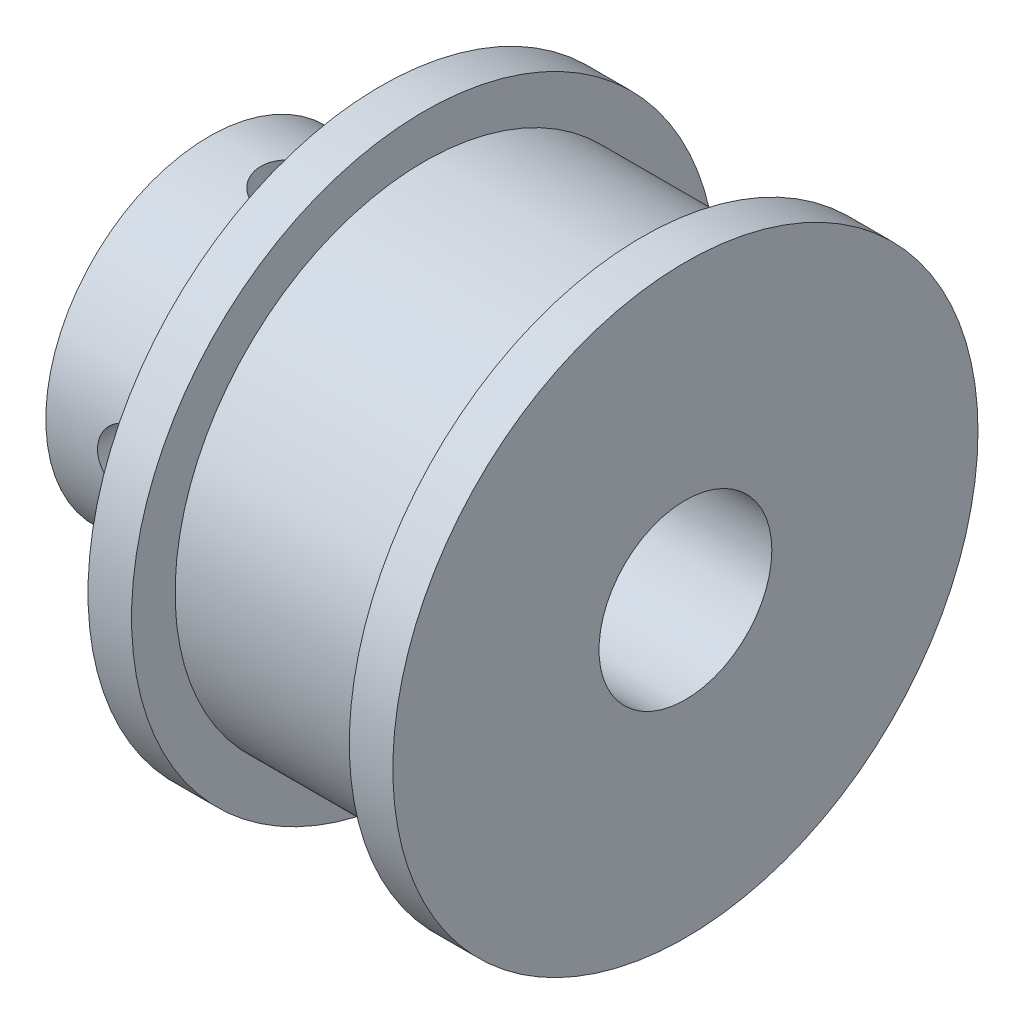
ISO-10303-21;
HEADER;
FILE_DESCRIPTION(('STEP AP214'),'2;1');
FILE_NAME('part.step','',(''),(''),'','','');
FILE_SCHEMA(('AUTOMOTIVE_DESIGN { 1 0 10303 214 1 1 1 1 }'));
ENDSEC;
DATA;
#1=APPLICATION_CONTEXT('core data for automotive mechanical design processes');
#2=APPLICATION_PROTOCOL_DEFINITION('international standard','automotive_design',2000,#1);
#3=PRODUCT_CONTEXT('',#1,'mechanical');
#4=PRODUCT('Part','Part','',(#3));
#5=PRODUCT_RELATED_PRODUCT_CATEGORY('part','',(#4));
#6=PRODUCT_DEFINITION_FORMATION('','',#4);
#7=PRODUCT_DEFINITION_CONTEXT('part definition',#1,'design');
#8=PRODUCT_DEFINITION('design','',#6,#7);
#9=PRODUCT_DEFINITION_SHAPE('','',#8);
#10=(LENGTH_UNIT() NAMED_UNIT(*) SI_UNIT(.MILLI.,.METRE.));
#11=(NAMED_UNIT(*) PLANE_ANGLE_UNIT() SI_UNIT($,.RADIAN.));
#12=(NAMED_UNIT(*) SI_UNIT($,.STERADIAN.) SOLID_ANGLE_UNIT());
#13=UNCERTAINTY_MEASURE_WITH_UNIT(LENGTH_MEASURE(1.E-05),#10,'distance_accuracy_value','');
#14=(GEOMETRIC_REPRESENTATION_CONTEXT(3) GLOBAL_UNCERTAINTY_ASSIGNED_CONTEXT((#13)) GLOBAL_UNIT_ASSIGNED_CONTEXT((#10,
#11,#12)) REPRESENTATION_CONTEXT('',''));
#15=CARTESIAN_POINT('',(0.,0.,0.));
#16=DIRECTION('',(0.,0.,1.));
#17=DIRECTION('',(1.,0.,0.));
#18=AXIS2_PLACEMENT_3D('',#15,#16,#17);
#19=CARTESIAN_POINT('',(0.,0.,0.));
#20=DIRECTION('',(1.,0.,0.));
#21=DIRECTION('',(0.,0.,-1.));
#22=AXIS2_PLACEMENT_3D('',#19,#20,#21);
#23=CYLINDRICAL_SURFACE('',#22,3.175);
#24=CARTESIAN_POINT('',(1.90000000000001,0.,3.175));
#25=CARTESIAN_POINT('',(1.9000068627745,0.0672847316330924,3.17499501338285));
#26=CARTESIAN_POINT('',(1.90546359305505,0.1346703640608,3.17283650663751));
#27=CARTESIAN_POINT('',(1.92710352845715,0.267542369031608,3.16441250521978));
#28=CARTESIAN_POINT('',(1.94331412522152,0.333023444641002,3.15813652319774));
#29=CARTESIAN_POINT('',(1.9857829777871,0.459957962416117,3.14215557601542));
#30=CARTESIAN_POINT('',(2.01200951215206,0.521423409993961,3.1324614438269));
#31=CARTESIAN_POINT('',(2.07364090841074,0.63903164640658,3.11060223187218));
#32=CARTESIAN_POINT('',(2.1090429677438,0.695176053354679,3.09843790684371));
#33=CARTESIAN_POINT('',(2.1897376821198,0.803199302091193,3.07224897424454));
#34=CARTESIAN_POINT('',(2.23538195508738,0.854801684849634,3.05816785515032));
#35=CARTESIAN_POINT('',(2.33452307874792,0.949851027050096,3.029995134943));
#36=CARTESIAN_POINT('',(2.38802352829044,0.993294227940917,3.01590353198658));
#37=CARTESIAN_POINT('',(2.5041424024409,1.07262244667806,2.98863572549245));
#38=CARTESIAN_POINT('',(2.56705314443539,1.10810421355732,2.97552454842956));
#39=CARTESIAN_POINT('',(2.698544027874,1.16785949338492,2.95258553832485));
#40=CARTESIAN_POINT('',(2.7671215628923,1.19213812572271,2.94275620617845));
#41=CARTESIAN_POINT('',(2.90482457540723,1.22768807019404,2.92809906106053));
#42=CARTESIAN_POINT('',(2.97379138336201,1.2394876533875,2.92306908743274));
#43=CARTESIAN_POINT('',(3.11289538673181,1.25139521634013,2.91799267608066));
#44=CARTESIAN_POINT('',(3.18303201481214,1.2515087076257,2.91794388907308));
#45=CARTESIAN_POINT('',(3.31747264612622,1.24044215294952,2.92266241514435));
#46=CARTESIAN_POINT('',(3.38185243388379,1.2300187638983,2.9271070555664));
#47=CARTESIAN_POINT('',(3.50786207063953,1.19943319152663,2.93977143360488));
#48=CARTESIAN_POINT('',(3.56949145415953,1.17926936651212,2.94799180758784));
#49=CARTESIAN_POINT('',(3.68970949878321,1.12939589279822,2.9674595549287));
#50=CARTESIAN_POINT('',(3.74821240698525,1.09950293840843,2.97876432051874));
#51=CARTESIAN_POINT('',(3.85958183190654,1.03114819003906,3.00311044973729));
#52=CARTESIAN_POINT('',(3.91244626347388,0.992683242204219,3.01615245182717));
#53=CARTESIAN_POINT('',(4.01519223792226,0.90489847311778,3.04369028436772));
#54=CARTESIAN_POINT('',(4.06455620057866,0.854982538626526,3.05822195069566));
#55=CARTESIAN_POINT('',(4.15437521291328,0.747422600693478,3.08627133748347));
#56=CARTESIAN_POINT('',(4.19482859712145,0.68977715576794,3.09978886808114));
#57=CARTESIAN_POINT('',(4.26632885010501,0.566964697663757,3.12460676760529));
#58=CARTESIAN_POINT('',(4.29718676961865,0.501677729871156,3.13586122258918));
#59=CARTESIAN_POINT('',(4.34730502697112,0.366284378650628,3.15453954285868));
#60=CARTESIAN_POINT('',(4.36657106552982,0.296180383098904,3.16196529078971));
#61=CARTESIAN_POINT('',(4.39192526522841,0.15748598181363,3.17180954080983));
#62=CARTESIAN_POINT('',(4.398709348115,0.08904145870925,3.174492125026));
#63=CARTESIAN_POINT('',(4.4009546291958,-0.0480536320474739,3.17537559014029));
#64=CARTESIAN_POINT('',(4.39641864995898,-0.116704144074904,3.17357758823769));
#65=CARTESIAN_POINT('',(4.3766688987383,-0.249146112043378,3.1658751934269));
#66=CARTESIAN_POINT('',(4.36192521803439,-0.313019327348947,3.16015168509209));
#67=CARTESIAN_POINT('',(4.32281288402532,-0.437330047990826,3.14535985768854));
#68=CARTESIAN_POINT('',(4.29844298886303,-0.497767108885045,3.1362911070673));
#69=CARTESIAN_POINT('',(4.23997777394203,-0.615550644692232,3.11535083253378));
#70=CARTESIAN_POINT('',(4.20560984846939,-0.672747743207499,3.10340262881889));
#71=CARTESIAN_POINT('',(4.12842792642724,-0.780761917259374,3.07800576012949));
#72=CARTESIAN_POINT('',(4.08561060602606,-0.831576469108153,3.06455650557748));
#73=CARTESIAN_POINT('',(3.98952965745297,-0.928791348114859,3.0365593899859));
#74=CARTESIAN_POINT('',(3.93577293586608,-0.974701227513619,3.02199629492691));
#75=CARTESIAN_POINT('',(3.82105274982168,-1.05696284943212,2.99421855171024));
#76=CARTESIAN_POINT('',(3.76008825217309,-1.09331321924023,2.98100409737911));
#77=CARTESIAN_POINT('',(3.63187774635261,-1.15559997165607,2.95742074651155));
#78=CARTESIAN_POINT('',(3.56458459593159,-1.18144907129597,2.9470759174758));
#79=CARTESIAN_POINT('',(3.4260725952737,-1.2212562072246,2.93080697789355));
#80=CARTESIAN_POINT('',(3.35485655568267,-1.23522264211379,2.92487974538276));
#81=CARTESIAN_POINT('',(3.21589405502895,-1.25007804085777,2.91855940228496));
#82=CARTESIAN_POINT('',(3.1482538653394,-1.25181430561831,2.91780781401761));
#83=CARTESIAN_POINT('',(3.01369577979596,-1.24437120429059,2.92098982763324));
#84=CARTESIAN_POINT('',(2.94677779981834,-1.23519312367105,2.92492287776943));
#85=CARTESIAN_POINT('',(2.81810207173594,-1.20686591196944,2.93671925445626));
#86=CARTESIAN_POINT('',(2.75624498467543,-1.18809939057282,2.9444313340829));
#87=CARTESIAN_POINT('',(2.63652982106708,-1.14148049607648,2.96281485611587));
#88=CARTESIAN_POINT('',(2.57867280512971,-1.1136257243581,2.97348707966731));
#89=CARTESIAN_POINT('',(2.4650674647447,-1.04781462002773,2.99733186522452));
#90=CARTESIAN_POINT('',(2.40961923756217,-1.00937948877753,3.01061106475901));
#91=CARTESIAN_POINT('',(2.30568987821778,-0.924206507043676,3.0378387527675));
#92=CARTESIAN_POINT('',(2.25721118976831,-0.877465757163235,3.05178747371865));
#93=CARTESIAN_POINT('',(2.16551587816836,-0.773553196077986,3.07982295515274));
#94=CARTESIAN_POINT('',(2.12281309958007,-0.715913819660185,3.09386447942524));
#95=CARTESIAN_POINT('',(2.04769454049986,-0.5937664037964,3.11960779538581));
#96=CARTESIAN_POINT('',(2.01528012935281,-0.529257451559142,3.13130927554577));
#97=CARTESIAN_POINT('',(1.96417540099936,-0.400855491445671,3.15020502613284));
#98=CARTESIAN_POINT('',(1.94455266817755,-0.337376283301317,3.15769788512325));
#99=CARTESIAN_POINT('',(1.91563614784328,-0.207895662632507,3.16884766902594));
#100=CARTESIAN_POINT('',(1.90631397142025,-0.141901703524203,3.17251513536217));
#101=CARTESIAN_POINT('',(1.90076135384054,-0.0504531001608372,3.17470085654944));
#102=CARTESIAN_POINT('',(1.8999974262687,-0.0252336457199433,3.17500187012012));
#103=CARTESIAN_POINT('',(1.90000000000001,0.,3.175));
#104=B_SPLINE_CURVE_WITH_KNOTS('',3,(#24,#25,#26,#27,#28,#29,#30,#31,#32,#33,#34,#35,#36,#37,
#38,#39,#40,#41,#42,#43,#44,#45,#46,#47,#48,#49,#50,#51,#52,#53,#54,#55,#56,#57,#58,#59,#60,#61,
#62,#63,#64,#65,#66,#67,#68,#69,#70,#71,#72,#73,#74,#75,#76,#77,#78,#79,#80,#81,#82,#83,#84,#85,
#86,#87,#88,#89,#90,#91,#92,#93,#94,#95,#96,#97,#98,#99,#100,#101,#102,#103),.UNSPECIFIED.,.T.,
.F.,(4,2,2,2,2,2,2,2,2,2,2,2,2,2,2,2,2,2,2,2,2,2,2,2,2,2,2,2,2,2,2,2,2,2,2,2,2,2,2,4),(0.,
0.201779437744548,0.404074820308127,0.605734757050763,0.807333171478417,1.01735976436243,
1.2274828705813,1.44660259463333,1.66562209023744,1.87494520835713,2.08416960269575,
2.27936669865592,2.47459670544107,2.67374147234743,2.87295963102294,3.08705517744558,
3.30119070642572,3.51930901537433,3.73731996902137,3.94275765182502,4.14814411546712,
4.34465147529728,4.54118419440118,4.7436789821994,4.94625358697288,5.1617892735487,
5.37735589340512,5.59467927329235,5.81184892233299,6.01381057507249,6.21574844354767,
6.41019345194811,6.60468982086286,6.81009090996547,7.01556384361703,7.2337987698656,
7.45206273023339,7.65177261299093,7.85093070050895,7.92660360165657),.UNSPECIFIED.);
#105=CARTESIAN_POINT('',(1.90000000000001,0.,3.175));
#106=VERTEX_POINT('',#105);
#107=EDGE_CURVE('E712',#106,#106,#104,.T.);
#108=ORIENTED_EDGE('',*,*,#107,.F.);
#109=EDGE_LOOP('',(#108));
#110=FACE_BOUND('',#109,.T.);
#111=CARTESIAN_POINT('',(3.15,2.91858270398493,-1.25));
#112=CARTESIAN_POINT('',(3.21705876770274,2.91858919552523,-1.24999286391997));
#113=CARTESIAN_POINT('',(3.28421776991305,2.92092645038722,-1.24457161253238));
#114=CARTESIAN_POINT('',(3.41661509708975,2.92998517442319,-1.2230858011541));
#115=CARTESIAN_POINT('',(3.48184795863823,2.93671805691524,-1.20699353198018));
#116=CARTESIAN_POINT('',(3.60825570633315,2.95367783504784,-1.16486992778129));
#117=CARTESIAN_POINT('',(3.66944461339327,2.96389181028401,-1.13887530486567));
#118=CARTESIAN_POINT('',(3.78657755098346,2.98664490940932,-1.07779173231123));
#119=CARTESIAN_POINT('',(3.84252284402701,2.99918347142755,-1.04270497949831));
#120=CARTESIAN_POINT('',(3.95071189018399,3.02595080926506,-0.962353829492942));
#121=CARTESIAN_POINT('',(4.00262881457917,3.04023283739072,-0.916666915264533));
#122=CARTESIAN_POINT('',(4.09830169841413,3.06843728874988,-0.817302314146456));
#123=CARTESIAN_POINT('',(4.1420548518516,3.08235958692784,-0.763621891133198));
#124=CARTESIAN_POINT('',(4.22176349783716,3.10891201177461,-0.64728579706301));
#125=CARTESIAN_POINT('',(4.25735944266869,3.12147292007291,-0.584366556004033));
#126=CARTESIAN_POINT('',(4.31732314068053,3.14324422109986,-0.452850465301555));
#127=CARTESIAN_POINT('',(4.34169532800117,3.15245593668199,-0.384255870461471));
#128=CARTESIAN_POINT('',(4.37736018254707,3.16611423056324,-0.2467608971739));
#129=CARTESIAN_POINT('',(4.38921442617454,3.17076466636064,-0.178026840226493));
#130=CARTESIAN_POINT('',(4.40131288966092,3.17551190440968,-0.0393983009347702));
#131=CARTESIAN_POINT('',(4.40156129942229,3.17561035000669,0.0304957535146294));
#132=CARTESIAN_POINT('',(4.39075388885007,3.17136802875332,0.165409649899385));
#133=CARTESIAN_POINT('',(4.380312782763,3.16726865978232,0.230487686315578));
#134=CARTESIAN_POINT('',(4.34946532592636,3.15541444614498,0.357881536818985));
#135=CARTESIAN_POINT('',(4.32905824593686,3.14765933397851,0.420197148407344));
#136=CARTESIAN_POINT('',(4.27860558354179,3.12910832817148,0.541410179653869));
#137=CARTESIAN_POINT('',(4.24842031728481,3.11826866169305,0.600242482304685));
#138=CARTESIAN_POINT('',(4.17939703639771,3.09462975143761,0.712157346885298));
#139=CARTESIAN_POINT('',(4.1405560971742,3.08182984578998,0.765237956392509));
#140=CARTESIAN_POINT('',(4.05243182003348,3.05461022779038,0.867739124124568));
#141=CARTESIAN_POINT('',(4.00264013608172,3.04013927358102,0.916709689716655));
#142=CARTESIAN_POINT('',(3.89548656480707,3.01184461230875,1.00578635680649));
#143=CARTESIAN_POINT('',(3.83812236311636,2.99802110488019,1.04588973818711));
#144=CARTESIAN_POINT('',(3.71550154425415,2.9722444532213,1.11707822475766));
#145=CARTESIAN_POINT('',(3.6500754582507,2.96035090580402,1.14789479354929));
#146=CARTESIAN_POINT('',(3.5143696785953,2.94047661183176,1.19789603572418));
#147=CARTESIAN_POINT('',(3.44409305117512,2.93249341875955,1.21708798384633));
#148=CARTESIAN_POINT('',(3.30516034266536,2.92193314346724,1.24221885837745));
#149=CARTESIAN_POINT('',(3.2366574611002,2.9190621155793,1.24887973581001));
#150=CARTESIAN_POINT('',(3.09946758767574,2.91821507641654,1.25085924710212));
#151=CARTESIAN_POINT('',(3.03078065469026,2.92023765193577,1.24618115550066));
#152=CARTESIAN_POINT('',(2.89910081239854,2.92864903711891,1.22627220656949));
#153=CARTESIAN_POINT('',(2.83600149325999,2.93479414330475,1.21162973372095));
#154=CARTESIAN_POINT('',(2.71319369775327,2.95045928061593,1.17296502005911));
#155=CARTESIAN_POINT('',(2.65348596177989,2.95998004539956,1.14894074010909));
#156=CARTESIAN_POINT('',(2.53650689226705,2.98178824537218,1.09112415058302));
#157=CARTESIAN_POINT('',(2.47942723563771,2.99417074871089,1.05698098829747));
#158=CARTESIAN_POINT('',(2.37155358654007,3.02015852173764,0.980258179031947));
#159=CARTESIAN_POINT('',(2.32076210314278,3.03376427580628,0.937675181950988));
#160=CARTESIAN_POINT('',(2.22315311375844,3.06183438952279,0.841703377564378));
#161=CARTESIAN_POINT('',(2.17687527629868,3.07629098175068,0.787761391689884));
#162=CARTESIAN_POINT('',(2.09394958907587,3.1035190255834,0.672529083864432));
#163=CARTESIAN_POINT('',(2.05730202921282,3.1162904264532,0.611238540780897));
#164=CARTESIAN_POINT('',(1.99484313276734,3.13873566281396,0.482904338615098));
#165=CARTESIAN_POINT('',(1.96901930828488,3.14841306493411,0.415867417631866));
#166=CARTESIAN_POINT('',(1.92917965457089,3.16357142711523,0.277927786036162));
#167=CARTESIAN_POINT('',(1.91515764017672,3.16905458518296,0.207027121129187));
#168=CARTESIAN_POINT('',(1.90003726977397,3.17497850608976,0.0682260342168539));
#169=CARTESIAN_POINT('',(1.89817498964644,3.17571727826717,0.000420884757595325));
#170=CARTESIAN_POINT('',(1.90542306137319,3.1728670277863,-0.134500374630681));
#171=CARTESIAN_POINT('',(1.9145318409792,3.16927862524971,-0.201616581901098));
#172=CARTESIAN_POINT('',(1.94291936225415,3.15832315585951,-0.331261459507754));
#173=CARTESIAN_POINT('',(1.96189513645233,3.15106882901496,-0.393866748155006));
#174=CARTESIAN_POINT('',(2.00916415022582,3.13355246801338,-0.514998013360591));
#175=CARTESIAN_POINT('',(2.03745913359075,3.12328987099511,-0.573523223978585));
#176=CARTESIAN_POINT('',(2.10396081746341,3.10021124636329,-0.687642991756168));
#177=CARTESIAN_POINT('',(2.14254680575914,3.08730319204293,-0.742997519181306));
#178=CARTESIAN_POINT('',(2.22796048608835,3.0604965861267,-0.846674739986252));
#179=CARTESIAN_POINT('',(2.27479143506869,3.04659764440369,-0.894994640697079));
#180=CARTESIAN_POINT('',(2.3786645370051,3.01835076024438,-0.986204093974814));
#181=CARTESIAN_POINT('',(2.43614870477354,3.00402537078839,-1.02859889387657));
#182=CARTESIAN_POINT('',(2.55787929604743,2.97745127531598,-1.10316965268165));
#183=CARTESIAN_POINT('',(2.62212660256846,2.96520284101944,-1.13534427499941));
#184=CARTESIAN_POINT('',(2.74980593068555,2.94527735121899,-1.18601952811124));
#185=CARTESIAN_POINT('',(2.81281216952646,2.93729286701932,-1.20547430735444));
#186=CARTESIAN_POINT('',(2.94135798876503,2.92533709276108,-1.23421212719399));
#187=CARTESIAN_POINT('',(3.00688989438575,2.92135450819833,-1.24352380081826));
#188=CARTESIAN_POINT('',(3.09843968257498,2.91892238480656,-1.24920484852849));
#189=CARTESIAN_POINT('',(3.12421242994352,2.91858020765141,-1.25000274419244));
#190=CARTESIAN_POINT('',(3.15,2.91858270398493,-1.25));
#191=B_SPLINE_CURVE_WITH_KNOTS('',3,(#111,#112,#113,#114,#115,#116,#117,#118,#119,#120,#121,
#122,#123,#124,#125,#126,#127,#128,#129,#130,#131,#132,#133,#134,#135,#136,#137,#138,#139,#140,
#141,#142,#143,#144,#145,#146,#147,#148,#149,#150,#151,#152,#153,#154,#155,#156,#157,#158,#159,
#160,#161,#162,#163,#164,#165,#166,#167,#168,#169,#170,#171,#172,#173,#174,#175,#176,#177,#178,
#179,#180,#181,#182,#183,#184,#185,#186,#187,#188,#189,#190),.UNSPECIFIED.,.T.,.F.,(4,2,2,2,2,2,
2,2,2,2,2,2,2,2,2,2,2,2,2,2,2,2,2,2,2,2,2,2,2,2,2,2,2,2,2,2,2,2,2,4),(0.,0.20109806062216,
0.402720363484106,0.603602331741175,0.804435808400704,1.01535170829682,1.22633996993093,
1.44534686764129,1.66426716849029,1.87288447318198,2.08142646291369,2.27861453584364,
2.47581703977309,2.67597098178837,2.87619265497002,3.08919652800103,3.30226565219754,
3.52100766319138,3.73961264265535,3.94518390476032,4.1506958077731,4.34501913391243,
4.5393847197749,4.74148953365143,4.94367473209367,5.16024174600764,5.37681527848653,
5.59313824650931,5.80934777198827,6.01183163883026,6.21428649142563,6.41086299855999,
6.60747630956881,6.81268639074811,7.01797771720266,7.23549456942807,7.45303985660975,
7.65144122721413,7.84928106635439,7.92661368823473),.UNSPECIFIED.);
#192=CARTESIAN_POINT('',(3.15,2.91858270398493,-1.25));
#193=VERTEX_POINT('',#192);
#194=EDGE_CURVE('E728',#193,#193,#191,.T.);
#195=ORIENTED_EDGE('',*,*,#194,.F.);
#196=EDGE_LOOP('',(#195));
#197=FACE_BOUND('',#196,.T.);
#198=CARTESIAN_POINT('',(17.5,0.,0.));
#199=DIRECTION('',(1.,0.,0.));
#200=DIRECTION('',(0.,0.,-1.));
#201=AXIS2_PLACEMENT_3D('',#198,#199,#200);
#202=CIRCLE('',#201,3.175);
#203=CARTESIAN_POINT('',(17.5,0.,-3.175));
#204=VERTEX_POINT('',#203);
#205=EDGE_CURVE('E754',#204,#204,#202,.T.);
#206=ORIENTED_EDGE('',*,*,#205,.T.);
#207=EDGE_LOOP('',(#206));
#208=FACE_BOUND('',#207,.T.);
#209=CARTESIAN_POINT('',(0.,0.,0.));
#210=DIRECTION('',(1.,0.,0.));
#211=DIRECTION('',(0.,0.,-1.));
#212=AXIS2_PLACEMENT_3D('',#209,#210,#211);
#213=CIRCLE('',#212,3.175);
#214=CARTESIAN_POINT('',(0.,0.,-3.175));
#215=VERTEX_POINT('',#214);
#216=EDGE_CURVE('E12',#215,#215,#213,.T.);
#217=ORIENTED_EDGE('',*,*,#216,.F.);
#218=EDGE_LOOP('',(#217));
#219=FACE_BOUND('',#218,.T.);
#220=ADVANCED_FACE('F708',(#110,#197,#208,#219),#23,.F.);
#221=CARTESIAN_POINT('',(0.,3.175,0.));
#222=DIRECTION('',(-1.,0.,0.));
#223=DIRECTION('',(0.,0.,1.));
#224=AXIS2_PLACEMENT_3D('',#221,#222,#223);
#225=PLANE('',#224);
#226=ORIENTED_EDGE('',*,*,#216,.T.);
#227=EDGE_LOOP('',(#226));
#228=FACE_BOUND('',#227,.T.);
#229=CARTESIAN_POINT('',(0.,0.,0.));
#230=DIRECTION('',(1.,0.,0.));
#231=DIRECTION('',(0.,0.,-1.));
#232=AXIS2_PLACEMENT_3D('',#229,#230,#231);
#233=CIRCLE('',#232,6.);
#234=CARTESIAN_POINT('',(0.,0.,-6.));
#235=VERTEX_POINT('',#234);
#236=EDGE_CURVE('E720',#235,#235,#233,.T.);
#237=ORIENTED_EDGE('',*,*,#236,.F.);
#238=EDGE_LOOP('',(#237));
#239=FACE_BOUND('',#238,.T.);
#240=ADVANCED_FACE('F764',(#228,#239),#225,.T.);
#241=CARTESIAN_POINT('',(0.,0.,0.));
#242=DIRECTION('',(1.,0.,0.));
#243=DIRECTION('',(0.,0.,-1.));
#244=AXIS2_PLACEMENT_3D('',#241,#242,#243);
#245=CYLINDRICAL_SURFACE('',#244,6.);
#246=CARTESIAN_POINT('',(1.90000000000001,0.,6.));
#247=CARTESIAN_POINT('',(1.90000247746923,-0.0694090417016603,5.99999871526651));
#248=CARTESIAN_POINT('',(1.90580066571876,-0.138848789520875,5.99878328775043));
#249=CARTESIAN_POINT('',(1.92881934953286,-0.275761316266992,5.99405200990679));
#250=CARTESIAN_POINT('',(1.94604852303694,-0.343232560128311,5.99053441189248));
#251=CARTESIAN_POINT('',(1.99137045492183,-0.474209132291339,5.98159109196202));
#252=CARTESIAN_POINT('',(2.01945239599889,-0.537718336709182,5.97616727052645));
#253=CARTESIAN_POINT('',(2.08564960885619,-0.659120328605954,5.96399927809859));
#254=CARTESIAN_POINT('',(2.12376443115584,-0.717013367534323,5.95725516625975));
#255=CARTESIAN_POINT('',(2.20953634019065,-0.826390324308832,5.9430770002465));
#256=CARTESIAN_POINT('',(2.25731200123509,-0.87778024416268,5.93563505848531));
#257=CARTESIAN_POINT('',(2.36079465919511,-0.971877776769387,5.92095657692448));
#258=CARTESIAN_POINT('',(2.41650231187227,-1.01458467096098,5.91372005416683));
#259=CARTESIAN_POINT('',(2.53495196876616,-1.09051031677216,5.90019442595308));
#260=CARTESIAN_POINT('',(2.59775838450275,-1.1236305468065,5.89391545174828));
#261=CARTESIAN_POINT('',(2.72819745177276,-1.17881119348063,5.8831284065002));
#262=CARTESIAN_POINT('',(2.79582958244254,-1.20087280167641,5.87862014467568));
#263=CARTESIAN_POINT('',(2.93298523741564,-1.23300240133736,5.87196500986123));
#264=CARTESIAN_POINT('',(3.00246835933477,-1.24323597696798,5.86978556855865));
#265=CARTESIAN_POINT('',(3.14219684286263,-1.25193357655614,5.86793690716491));
#266=CARTESIAN_POINT('',(3.2124421188653,-1.25039890894686,5.86826740800981));
#267=CARTESIAN_POINT('',(3.35048102797518,-1.23573719037196,5.87137174319175));
#268=CARTESIAN_POINT('',(3.41829597966121,-1.2228010523272,5.87410533679901));
#269=CARTESIAN_POINT('',(3.55077150964493,-1.18600543529945,5.88164437615942));
#270=CARTESIAN_POINT('',(3.61543192560633,-1.16214539481381,5.88644992841317));
#271=CARTESIAN_POINT('',(3.74030722841598,-1.10400003213928,5.89763191464102));
#272=CARTESIAN_POINT('',(3.80048629652707,-1.06964002534236,5.90401953785586));
#273=CARTESIAN_POINT('',(3.91429574426816,-0.991522699274812,5.91763890010721));
#274=CARTESIAN_POINT('',(3.96792530883597,-0.947764212262582,5.92487074398537));
#275=CARTESIAN_POINT('',(4.06821396108037,-0.851074921546777,5.93953730929909));
#276=CARTESIAN_POINT('',(4.11471616889701,-0.797981433412077,5.94697323199473));
#277=CARTESIAN_POINT('',(4.19818044222897,-0.684667288611794,5.96108088143001));
#278=CARTESIAN_POINT('',(4.23514236459839,-0.624446525025762,5.96775259670236));
#279=CARTESIAN_POINT('',(4.29851008153595,-0.498405541235475,5.97959870942815));
#280=CARTESIAN_POINT('',(4.32489680456711,-0.432575461926497,5.98477039710258));
#281=CARTESIAN_POINT('',(4.36619170483549,-0.297284620972153,5.99301338211281));
#282=CARTESIAN_POINT('',(4.38110139323139,-0.227824338595088,5.99608495596053));
#283=CARTESIAN_POINT('',(4.39879425206788,-0.0885918657008349,5.99974275215455));
#284=CARTESIAN_POINT('',(4.40179194149424,-0.0188480555261788,6.00037293537579));
#285=CARTESIAN_POINT('',(4.39615505003089,0.120143798757714,5.99919952252774));
#286=CARTESIAN_POINT('',(4.3875211813984,0.189391872962257,5.99739607548153));
#287=CARTESIAN_POINT('',(4.35904434653046,0.324726367119811,5.99158564979184));
#288=CARTESIAN_POINT('',(4.33931251461653,0.390837192894204,5.98760052868077));
#289=CARTESIAN_POINT('',(4.28932213957859,0.518811446661328,5.97787227242395));
#290=CARTESIAN_POINT('',(4.25906275913401,0.580674536336772,5.97212899744579));
#291=CARTESIAN_POINT('',(4.18841962176244,0.69929430694349,5.95941241490714));
#292=CARTESIAN_POINT('',(4.14790807043093,0.755973219469829,5.9524239381233));
#293=CARTESIAN_POINT('',(4.05808043692373,0.861805445886515,5.93802568299709));
#294=CARTESIAN_POINT('',(4.00876332448106,0.910957877913281,5.93061585542511));
#295=CARTESIAN_POINT('',(3.9017444230003,1.0011786486518,5.91606024531377));
#296=CARTESIAN_POINT('',(3.84391696804472,1.04209914600204,5.90892089307501));
#297=CARTESIAN_POINT('',(3.72208371578621,1.11364719079243,5.89585601015805));
#298=CARTESIAN_POINT('',(3.65807817586089,1.14427516677863,5.88993042894651));
#299=CARTESIAN_POINT('',(3.52603880370177,1.19417246443921,5.88001700708041));
#300=CARTESIAN_POINT('',(3.45802896283416,1.21350309828031,5.87601872784687));
#301=CARTESIAN_POINT('',(3.31963344950774,1.24044038523407,5.87039184709697));
#302=CARTESIAN_POINT('',(3.24924811838056,1.2480487154444,5.86876290660367));
#303=CARTESIAN_POINT('',(3.10958659900035,1.25125926487611,5.86807907308506));
#304=CARTESIAN_POINT('',(3.04031592977795,1.24709542622725,5.86897402321502));
#305=CARTESIAN_POINT('',(2.90348599107978,1.22739905314031,5.87312447254928));
#306=CARTESIAN_POINT('',(2.8359267051839,1.21186662782265,5.87637994909626));
#307=CARTESIAN_POINT('',(2.70460222810934,1.16998217768584,5.88486132447716));
#308=CARTESIAN_POINT('',(2.64082675351308,1.14366117568421,5.8900815700793));
#309=CARTESIAN_POINT('',(2.51856122397334,1.08097457299757,5.90190705738738));
#310=CARTESIAN_POINT('',(2.46007166036688,1.04460803983029,5.9085124276546));
#311=CARTESIAN_POINT('',(2.34887837292056,0.962073695342405,5.92251579551146));
#312=CARTESIAN_POINT('',(2.29630087543502,0.91573789041822,5.92992613868404));
#313=CARTESIAN_POINT('',(2.19959050677365,0.814924438115329,5.94461839583213));
#314=CARTESIAN_POINT('',(2.15545958244852,0.760444918832963,5.9519002798488));
#315=CARTESIAN_POINT('',(2.07641142681595,0.644134427507699,5.96561444547637));
#316=CARTESIAN_POINT('',(2.04160632011372,0.582225921521345,5.97203596073244));
#317=CARTESIAN_POINT('',(1.98294977156998,0.453319843998451,5.98319908494092));
#318=CARTESIAN_POINT('',(1.95908875281813,0.386326781907242,5.98794216182101));
#319=CARTESIAN_POINT('',(1.92745972171158,0.266015292900104,5.99432499781443));
#320=CARTESIAN_POINT('',(1.91718123679115,0.213367593727928,5.99644035661395));
#321=CARTESIAN_POINT('',(1.90345054572268,0.107152674176536,5.99927832789758));
#322=CARTESIAN_POINT('',(1.89999808733282,0.0535854878488715,6.00000099184586));
#323=CARTESIAN_POINT('',(1.90000000000001,0.,6.));
#324=B_SPLINE_CURVE_WITH_KNOTS('',3,(#246,#247,#248,#249,#250,#251,#252,#253,#254,#255,#256,
#257,#258,#259,#260,#261,#262,#263,#264,#265,#266,#267,#268,#269,#270,#271,#272,#273,#274,#275,
#276,#277,#278,#279,#280,#281,#282,#283,#284,#285,#286,#287,#288,#289,#290,#291,#292,#293,#294,
#295,#296,#297,#298,#299,#300,#301,#302,#303,#304,#305,#306,#307,#308,#309,#310,#311,#312,#313,
#314,#315,#316,#317,#318,#319,#320,#321,#322,#323),.UNSPECIFIED.,.T.,.F.,(4,2,2,2,2,2,2,2,2,2,2,
2,2,2,2,2,2,2,2,2,2,2,2,2,2,2,2,2,2,2,2,2,2,2,2,2,2,2,4),(0.,0.208031045103182,
0.416220199906223,0.624202378825439,0.832175241572985,1.04287526388122,1.25359271551785,
1.46640449178548,1.67919333285489,1.88896575169853,2.09871484767163,2.30501712129058,
2.51133000030278,2.71914592416748,2.92698768368033,3.13889526355464,3.35080602278216,
3.5630972449966,3.77536051045769,3.98378339407673,4.19219351552275,4.39855286632619,
4.60492863390931,4.81401583995734,5.02312752564571,5.23571263829333,5.44828889851306,
5.65970050095022,5.87108185414182,6.07829223291035,6.28550062281358,6.49211731393252,
6.69875319081476,6.90919024830305,7.11967575117366,7.33258864398252,7.54531486464969,
7.70592588477276,7.86653096973387),.UNSPECIFIED.);
#325=CARTESIAN_POINT('',(1.90000000000001,0.,6.));
#326=VERTEX_POINT('',#325);
#327=EDGE_CURVE('E735',#326,#326,#324,.T.);
#328=ORIENTED_EDGE('',*,*,#327,.F.);
#329=EDGE_LOOP('',(#328));
#330=FACE_BOUND('',#329,.T.);
#331=CARTESIAN_POINT('',(3.15,5.86834729715275,-1.25));
#332=CARTESIAN_POINT('',(3.08060938484897,5.86834869213645,-1.24999750877599));
#333=CARTESIAN_POINT('',(3.01118802798478,5.86959145924544,-1.24420229433948));
#334=CARTESIAN_POINT('',(2.87431368268275,5.87442015581798,-1.22119649233779));
#335=CARTESIAN_POINT('',(2.80686224449358,5.87800788138388,-1.20397715440342));
#336=CARTESIAN_POINT('',(2.67592762716513,5.8871029296193,-1.1586839750723));
#337=CARTESIAN_POINT('',(2.6124404040082,5.89260825706945,-1.13062141248932));
#338=CARTESIAN_POINT('',(2.4910755003544,5.90491581335741,-1.06446988601732));
#339=CARTESIAN_POINT('',(2.43319759326998,5.91171798977622,-1.0263813273582));
#340=CARTESIAN_POINT('',(2.32380462484654,5.92596934661468,-0.940636399466082));
#341=CARTESIAN_POINT('',(2.27238810637353,5.93342614373039,-0.892855554869668));
#342=CARTESIAN_POINT('',(2.1782389313519,5.94807966802575,-0.789351223880636));
#343=CARTESIAN_POINT('',(2.13550691170856,5.95527637609915,-0.733627155456002));
#344=CARTESIAN_POINT('',(2.05955411191714,5.96868135118848,-0.615162052999588));
#345=CARTESIAN_POINT('',(2.02642747353674,5.97487958631242,-0.552359428204941));
#346=CARTESIAN_POINT('',(1.97123394714022,5.98550347343302,-0.421928551006719));
#347=CARTESIAN_POINT('',(1.94916593484647,5.98992930561222,-0.354300789950591));
#348=CARTESIAN_POINT('',(1.91702423888253,5.99645589892179,-0.217162904200502));
#349=CARTESIAN_POINT('',(1.90678398280484,5.99858891959926,-0.147693380916357));
#350=CARTESIAN_POINT('',(1.89806830424298,6.00040112580612,-0.00799184883952432));
#351=CARTESIAN_POINT('',(1.8995916558069,6.0000805670369,0.0622400797368385));
#352=CARTESIAN_POINT('',(1.91423460095674,5.99704658090511,0.200326586199572));
#353=CARTESIAN_POINT('',(1.92717471895812,5.99437018956584,0.268201128726475));
#354=CARTESIAN_POINT('',(1.96399862533131,5.98696720898885,0.400793746289752));
#355=CARTESIAN_POINT('',(1.98788287720308,5.98224053291904,0.465511687511022));
#356=CARTESIAN_POINT('',(2.0460800521255,5.97120767323924,0.590460005384683));
#357=CARTESIAN_POINT('',(2.08046229420966,5.96489104125346,0.65065713498165));
#358=CARTESIAN_POINT('',(2.15862800284042,5.95137300440189,0.764493456510647));
#359=CARTESIAN_POINT('',(2.20241263820613,5.94417148958325,0.818131831816418));
#360=CARTESIAN_POINT('',(2.29912162489106,5.92951700233276,0.918394203276912));
#361=CARTESIAN_POINT('',(2.35220305998195,5.92206184975925,0.964866487494794));
#362=CARTESIAN_POINT('',(2.4654820489948,5.90786872648996,1.04827597240488));
#363=CARTESIAN_POINT('',(2.52567976138724,5.9011307717716,1.0852129606998));
#364=CARTESIAN_POINT('',(2.6517122548288,5.88912998409156,1.14856217138454));
#365=CARTESIAN_POINT('',(2.71756065069343,5.88387085232125,1.17494805489727));
#366=CARTESIAN_POINT('',(2.85289161936939,5.8754760641036,1.21623577538673));
#367=CARTESIAN_POINT('',(2.92237367280809,5.87234010507182,1.23113924882349));
#368=CARTESIAN_POINT('',(3.06161970631891,5.86860783239132,1.24880863867017));
#369=CARTESIAN_POINT('',(3.13135458453703,5.86796551863474,1.25179442917998));
#370=CARTESIAN_POINT('',(3.27032581154014,5.86916952018704,1.24613693439294));
#371=CARTESIAN_POINT('',(3.33956219090234,5.87101568152623,1.23749436857863));
#372=CARTESIAN_POINT('',(3.47482051605812,5.87694538226166,1.20901558325484));
#373=CARTESIAN_POINT('',(3.54086866717883,5.88100511282998,1.18929841376871));
#374=CARTESIAN_POINT('',(3.6687239894416,5.8908833850312,1.13935810860919));
#375=CARTESIAN_POINT('',(3.7305307856504,5.89670208191057,1.10913404556146));
#376=CARTESIAN_POINT('',(3.84910644121623,5.90954501937191,1.03854598181485));
#377=CARTESIAN_POINT('',(3.90579220446617,5.91658506648323,0.998045327353962));
#378=CARTESIAN_POINT('',(4.01164324915506,5.93103483993908,0.908234440569878));
#379=CARTESIAN_POINT('',(4.06080768623923,5.93844460766532,0.858923220505172));
#380=CARTESIAN_POINT('',(4.15106271309716,5.95294924316736,0.751900450843339));
#381=CARTESIAN_POINT('',(4.19200409502638,5.9600367471991,0.694061907614551));
#382=CARTESIAN_POINT('',(4.26358875208798,5.97296708772407,0.57220010221636));
#383=CARTESIAN_POINT('',(4.29423248223745,5.97880997920818,0.508177113476881));
#384=CARTESIAN_POINT('',(4.34413867931735,5.98856148270679,0.376142117847919));
#385=CARTESIAN_POINT('',(4.36346916554434,5.99248163136497,0.308156710970195));
#386=CARTESIAN_POINT('',(4.3904144040081,5.99799561410226,0.169813400503473));
#387=CARTESIAN_POINT('',(4.39803069353274,5.99958975342889,0.0994558094616958));
#388=CARTESIAN_POINT('',(4.40126762204851,6.00026408056941,-0.0402133434703387));
#389=CARTESIAN_POINT('',(4.39711189999473,5.99939113754811,-0.109519592177922));
#390=CARTESIAN_POINT('',(4.37741936134707,5.99532874094472,-0.246422870373552));
#391=CARTESIAN_POINT('',(4.36188271359323,5.99213932172839,-0.314019925202702));
#392=CARTESIAN_POINT('',(4.31997220535144,5.98380460077544,-0.445431965492052));
#393=CARTESIAN_POINT('',(4.29362733614689,5.97866453407556,-0.509256550004524));
#394=CARTESIAN_POINT('',(4.230877602268,5.96697995347704,-0.631610567220741));
#395=CARTESIAN_POINT('',(4.19447186165686,5.96043531730246,-0.690139538279511));
#396=CARTESIAN_POINT('',(4.11189033200669,5.94651596786386,-0.80134032129826));
#397=CARTESIAN_POINT('',(4.0655557119433,5.93912880302851,-0.853892633615926));
#398=CARTESIAN_POINT('',(3.96475549900292,5.9244278681135,-0.950552741980385));
#399=CARTESIAN_POINT('',(3.91028797005157,5.91711411595368,-0.994658521571232));
#400=CARTESIAN_POINT('',(3.79399089756656,5.90329191643327,-1.07367451852767));
#401=CARTESIAN_POINT('',(3.73208158853791,5.89679406702551,-1.10846928126994));
#402=CARTESIAN_POINT('',(3.60317484391674,5.88547039658063,-1.16710627925306));
#403=CARTESIAN_POINT('',(3.53618195154699,5.88064310352601,-1.1909581629246));
#404=CARTESIAN_POINT('',(3.41589371843157,5.87414004405196,-1.22256554131861));
#405=CARTESIAN_POINT('',(3.36327046340695,5.87198163591589,-1.2328344900567));
#406=CARTESIAN_POINT('',(3.25710421947899,5.86908475266778,-1.24655254358404));
#407=CARTESIAN_POINT('',(3.20356126768996,5.86834622039193,-1.25000192292741));
#408=CARTESIAN_POINT('',(3.15,5.86834729715275,-1.25));
#409=B_SPLINE_CURVE_WITH_KNOTS('',3,(#331,#332,#333,#334,#335,#336,#337,#338,#339,#340,#341,
#342,#343,#344,#345,#346,#347,#348,#349,#350,#351,#352,#353,#354,#355,#356,#357,#358,#359,#360,
#361,#362,#363,#364,#365,#366,#367,#368,#369,#370,#371,#372,#373,#374,#375,#376,#377,#378,#379,
#380,#381,#382,#383,#384,#385,#386,#387,#388,#389,#390,#391,#392,#393,#394,#395,#396,#397,#398,
#399,#400,#401,#402,#403,#404,#405,#406,#407,#408),.UNSPECIFIED.,.T.,.F.,(4,2,2,2,2,2,2,2,2,2,2,
2,2,2,2,2,2,2,2,2,2,2,2,2,2,2,2,2,2,2,2,2,2,2,2,2,2,2,4),(0.,0.207975654071269,0.41611079241747,
0.624030014802729,0.831940834815791,1.04271333467885,1.25350128663874,1.46629026266844,
1.67905760106933,1.88879048859264,2.09850151896339,2.30497341416461,2.5114540545587,
2.71932871977949,2.9272292410426,3.13905862244913,3.35089272191628,3.56325237332487,
3.77558175387597,3.98397516009792,4.19235567296524,4.39853786231922,4.60473825464031,
4.81383917934651,5.02296356082185,5.23559458753343,5.4482162175904,5.65954599648534,
5.87084803959581,6.07816293922644,6.28547476332981,6.492234105851,6.69901145528173,
6.90938318978573,7.11980508427535,7.33272651358123,7.54545984571988,7.70599867585769,
7.8665310426116),.UNSPECIFIED.);
#410=CARTESIAN_POINT('',(3.15,5.86834729715275,-1.25));
#411=VERTEX_POINT('',#410);
#412=EDGE_CURVE('E734',#411,#411,#409,.T.);
#413=ORIENTED_EDGE('',*,*,#412,.F.);
#414=EDGE_LOOP('',(#413));
#415=FACE_BOUND('',#414,.T.);
#416=ORIENTED_EDGE('',*,*,#236,.T.);
#417=EDGE_LOOP('',(#416));
#418=FACE_BOUND('',#417,.T.);
#419=CARTESIAN_POINT('',(6.3,0.,0.));
#420=DIRECTION('',(1.,0.,0.));
#421=DIRECTION('',(0.,0.,-1.));
#422=AXIS2_PLACEMENT_3D('',#419,#420,#421);
#423=CIRCLE('',#422,6.);
#424=CARTESIAN_POINT('',(6.3,0.,-6.));
#425=VERTEX_POINT('',#424);
#426=EDGE_CURVE('E725',#425,#425,#423,.T.);
#427=ORIENTED_EDGE('',*,*,#426,.F.);
#428=EDGE_LOOP('',(#427));
#429=FACE_BOUND('',#428,.T.);
#430=ADVANCED_FACE('F759',(#330,#415,#418,#429),#245,.T.);
#431=CARTESIAN_POINT('',(6.3,10.75,0.));
#432=DIRECTION('',(-1.,0.,0.));
#433=DIRECTION('',(0.,0.,1.));
#434=AXIS2_PLACEMENT_3D('',#431,#432,#433);
#435=PLANE('',#434);
#436=ORIENTED_EDGE('',*,*,#426,.T.);
#437=EDGE_LOOP('',(#436));
#438=FACE_BOUND('',#437,.T.);
#439=CARTESIAN_POINT('',(6.3,0.,0.));
#440=DIRECTION('',(1.,0.,0.));
#441=DIRECTION('',(0.,0.,-1.));
#442=AXIS2_PLACEMENT_3D('',#439,#440,#441);
#443=CIRCLE('',#442,10.75);
#444=CARTESIAN_POINT('',(6.3,0.,-10.75));
#445=VERTEX_POINT('',#444);
#446=EDGE_CURVE('E780',#445,#445,#443,.T.);
#447=ORIENTED_EDGE('',*,*,#446,.F.);
#448=EDGE_LOOP('',(#447));
#449=FACE_BOUND('',#448,.T.);
#450=ADVANCED_FACE('F763',(#438,#449),#435,.T.);
#451=CARTESIAN_POINT('',(0.,0.,0.));
#452=DIRECTION('',(1.,0.,0.));
#453=DIRECTION('',(0.,0.,-1.));
#454=AXIS2_PLACEMENT_3D('',#451,#452,#453);
#455=CYLINDRICAL_SURFACE('',#454,10.75);
#456=ORIENTED_EDGE('',*,*,#446,.T.);
#457=EDGE_LOOP('',(#456));
#458=FACE_BOUND('',#457,.T.);
#459=CARTESIAN_POINT('',(7.9,0.,0.));
#460=DIRECTION('',(1.,0.,0.));
#461=DIRECTION('',(0.,0.,-1.));
#462=AXIS2_PLACEMENT_3D('',#459,#460,#461);
#463=CIRCLE('',#462,10.75);
#464=CARTESIAN_POINT('',(7.9,0.,-10.75));
#465=VERTEX_POINT('',#464);
#466=EDGE_CURVE('E782',#465,#465,#463,.T.);
#467=ORIENTED_EDGE('',*,*,#466,.F.);
#468=EDGE_LOOP('',(#467));
#469=FACE_BOUND('',#468,.T.);
#470=ADVANCED_FACE('F824',(#458,#469),#455,.T.);
#471=CARTESIAN_POINT('',(7.9,10.75,0.));
#472=DIRECTION('',(1.,0.,0.));
#473=DIRECTION('',(0.,0.,-1.));
#474=AXIS2_PLACEMENT_3D('',#471,#472,#473);
#475=PLANE('',#474);
#476=ORIENTED_EDGE('',*,*,#466,.T.);
#477=EDGE_LOOP('',(#476));
#478=FACE_BOUND('',#477,.T.);
#479=CARTESIAN_POINT('',(7.9,0.,0.));
#480=DIRECTION('',(1.,0.,0.));
#481=DIRECTION('',(0.,0.,-1.));
#482=AXIS2_PLACEMENT_3D('',#479,#480,#481);
#483=CIRCLE('',#482,9.15);
#484=CARTESIAN_POINT('',(7.9,0.,-9.15));
#485=VERTEX_POINT('',#484);
#486=EDGE_CURVE('E787',#485,#485,#483,.T.);
#487=ORIENTED_EDGE('',*,*,#486,.F.);
#488=EDGE_LOOP('',(#487));
#489=FACE_BOUND('',#488,.T.);
#490=ADVANCED_FACE('F821',(#478,#489),#475,.T.);
#491=CARTESIAN_POINT('',(0.,0.,0.));
#492=DIRECTION('',(1.,0.,0.));
#493=DIRECTION('',(0.,0.,-1.));
#494=AXIS2_PLACEMENT_3D('',#491,#492,#493);
#495=CYLINDRICAL_SURFACE('',#494,9.15);
#496=ORIENTED_EDGE('',*,*,#486,.T.);
#497=EDGE_LOOP('',(#496));
#498=FACE_BOUND('',#497,.T.);
#499=CARTESIAN_POINT('',(15.9,0.,0.));
#500=DIRECTION('',(1.,0.,0.));
#501=DIRECTION('',(0.,0.,-1.));
#502=AXIS2_PLACEMENT_3D('',#499,#500,#501);
#503=CIRCLE('',#502,9.15);
#504=CARTESIAN_POINT('',(15.9,0.,-9.15));
#505=VERTEX_POINT('',#504);
#506=EDGE_CURVE('E790',#505,#505,#503,.T.);
#507=ORIENTED_EDGE('',*,*,#506,.F.);
#508=EDGE_LOOP('',(#507));
#509=FACE_BOUND('',#508,.T.);
#510=ADVANCED_FACE('F814',(#498,#509),#495,.T.);
#511=CARTESIAN_POINT('',(15.9,9.15,0.));
#512=DIRECTION('',(-1.,0.,0.));
#513=DIRECTION('',(0.,0.,1.));
#514=AXIS2_PLACEMENT_3D('',#511,#512,#513);
#515=PLANE('',#514);
#516=ORIENTED_EDGE('',*,*,#506,.T.);
#517=EDGE_LOOP('',(#516));
#518=FACE_BOUND('',#517,.T.);
#519=CARTESIAN_POINT('',(15.9,0.,0.));
#520=DIRECTION('',(1.,0.,0.));
#521=DIRECTION('',(0.,0.,-1.));
#522=AXIS2_PLACEMENT_3D('',#519,#520,#521);
#523=CIRCLE('',#522,10.75);
#524=CARTESIAN_POINT('',(15.9,0.,-10.75));
#525=VERTEX_POINT('',#524);
#526=EDGE_CURVE('E793',#525,#525,#523,.T.);
#527=ORIENTED_EDGE('',*,*,#526,.F.);
#528=EDGE_LOOP('',(#527));
#529=FACE_BOUND('',#528,.T.);
#530=ADVANCED_FACE('F809',(#518,#529),#515,.T.);
#531=CARTESIAN_POINT('',(0.,0.,0.));
#532=DIRECTION('',(1.,0.,0.));
#533=DIRECTION('',(0.,0.,-1.));
#534=AXIS2_PLACEMENT_3D('',#531,#532,#533);
#535=CYLINDRICAL_SURFACE('',#534,10.75);
#536=ORIENTED_EDGE('',*,*,#526,.T.);
#537=EDGE_LOOP('',(#536));
#538=FACE_BOUND('',#537,.T.);
#539=CARTESIAN_POINT('',(17.5,0.,0.));
#540=DIRECTION('',(1.,0.,0.));
#541=DIRECTION('',(0.,0.,-1.));
#542=AXIS2_PLACEMENT_3D('',#539,#540,#541);
#543=CIRCLE('',#542,10.75);
#544=CARTESIAN_POINT('',(17.5,0.,-10.75));
#545=VERTEX_POINT('',#544);
#546=EDGE_CURVE('E795',#545,#545,#543,.T.);
#547=ORIENTED_EDGE('',*,*,#546,.F.);
#548=EDGE_LOOP('',(#547));
#549=FACE_BOUND('',#548,.T.);
#550=ADVANCED_FACE('F805',(#538,#549),#535,.T.);
#551=CARTESIAN_POINT('',(17.5,10.75,0.));
#552=DIRECTION('',(1.,0.,0.));
#553=DIRECTION('',(0.,0.,-1.));
#554=AXIS2_PLACEMENT_3D('',#551,#552,#553);
#555=PLANE('',#554);
#556=ORIENTED_EDGE('',*,*,#546,.T.);
#557=EDGE_LOOP('',(#556));
#558=FACE_BOUND('',#557,.T.);
#559=ORIENTED_EDGE('',*,*,#205,.F.);
#560=EDGE_LOOP('',(#559));
#561=FACE_BOUND('',#560,.T.);
#562=ADVANCED_FACE('F741',(#558,#561),#555,.T.);
#563=CARTESIAN_POINT('',(3.15,0.,0.));
#564=DIRECTION('',(0.,-1.,0.));
#565=DIRECTION('',(0.,0.,-1.));
#566=AXIS2_PLACEMENT_3D('',#563,#564,#565);
#567=CYLINDRICAL_SURFACE('',#566,1.25);
#568=ORIENTED_EDGE('',*,*,#412,.T.);
#569=EDGE_LOOP('',(#568));
#570=FACE_BOUND('',#569,.T.);
#571=ORIENTED_EDGE('',*,*,#194,.T.);
#572=EDGE_LOOP('',(#571));
#573=FACE_BOUND('',#572,.T.);
#574=ADVANCED_FACE('F736',(#570,#573),#567,.F.);
#575=CARTESIAN_POINT('',(3.15,0.,0.));
#576=DIRECTION('',(0.,0.,-1.));
#577=DIRECTION('',(-1.,0.,0.));
#578=AXIS2_PLACEMENT_3D('',#575,#576,#577);
#579=CYLINDRICAL_SURFACE('',#578,1.24999999999999);
#580=ORIENTED_EDGE('',*,*,#327,.T.);
#581=EDGE_LOOP('',(#580));
#582=FACE_BOUND('',#581,.T.);
#583=ORIENTED_EDGE('',*,*,#107,.T.);
#584=EDGE_LOOP('',(#583));
#585=FACE_BOUND('',#584,.T.);
#586=ADVANCED_FACE('F740',(#582,#585),#579,.F.);
#587=CLOSED_SHELL('',(#220,#240,#430,#450,#470,#490,#510,#530,#550,#562,#574,#586));
#588=MANIFOLD_SOLID_BREP('B2',#587);
#589=ADVANCED_BREP_SHAPE_REPRESENTATION('',(#18,#588),#14);
#590=SHAPE_DEFINITION_REPRESENTATION(#9,#589);
ENDSEC;
END-ISO-10303-21;
